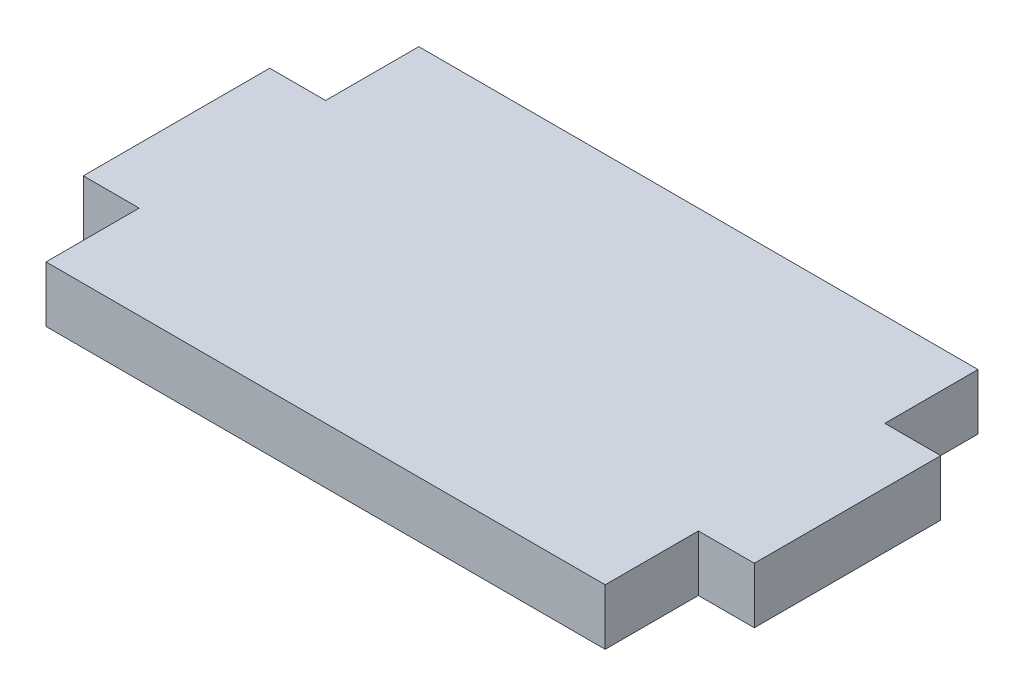
ISO-10303-21;
HEADER;
FILE_DESCRIPTION(('STEP AP214'),'2;1');
FILE_NAME('part.step','',(''),(''),'','','');
FILE_SCHEMA(('AUTOMOTIVE_DESIGN { 1 0 10303 214 1 1 1 1 }'));
ENDSEC;
DATA;
#1=APPLICATION_CONTEXT('core data for automotive mechanical design processes');
#2=APPLICATION_PROTOCOL_DEFINITION('international standard','automotive_design',2000,#1);
#3=PRODUCT_CONTEXT('',#1,'mechanical');
#4=PRODUCT('Part','Part','',(#3));
#5=PRODUCT_RELATED_PRODUCT_CATEGORY('part','',(#4));
#6=PRODUCT_DEFINITION_FORMATION('','',#4);
#7=PRODUCT_DEFINITION_CONTEXT('part definition',#1,'design');
#8=PRODUCT_DEFINITION('design','',#6,#7);
#9=PRODUCT_DEFINITION_SHAPE('','',#8);
#10=(LENGTH_UNIT() NAMED_UNIT(*) SI_UNIT(.MILLI.,.METRE.));
#11=(NAMED_UNIT(*) PLANE_ANGLE_UNIT() SI_UNIT($,.RADIAN.));
#12=(NAMED_UNIT(*) SI_UNIT($,.STERADIAN.) SOLID_ANGLE_UNIT());
#13=UNCERTAINTY_MEASURE_WITH_UNIT(LENGTH_MEASURE(1.E-05),#10,'distance_accuracy_value','');
#14=(GEOMETRIC_REPRESENTATION_CONTEXT(3) GLOBAL_UNCERTAINTY_ASSIGNED_CONTEXT((#13)) GLOBAL_UNIT_ASSIGNED_CONTEXT((#10,
#11,#12)) REPRESENTATION_CONTEXT('',''));
#15=CARTESIAN_POINT('',(0.,0.,0.));
#16=DIRECTION('',(0.,0.,1.));
#17=DIRECTION('',(1.,0.,0.));
#18=AXIS2_PLACEMENT_3D('',#15,#16,#17);
#19=CARTESIAN_POINT('',(-15.,3.,5.));
#20=DIRECTION('',(1.,0.,0.));
#21=DIRECTION('',(0.,0.,-1.));
#22=AXIS2_PLACEMENT_3D('',#19,#20,#21);
#23=PLANE('',#22);
#24=DIRECTION('',(0.,0.,1.));
#25=VECTOR('',#24,1.);
#26=CARTESIAN_POINT('',(-15.,0.,5.));
#27=LINE('',#26,#25);
#28=CARTESIAN_POINT('',(-15.,0.,5.));
#29=VERTEX_POINT('',#28);
#30=CARTESIAN_POINT('',(-15.,0.,10.));
#31=VERTEX_POINT('',#30);
#32=EDGE_CURVE('E153',#29,#31,#27,.T.);
#33=ORIENTED_EDGE('',*,*,#32,.T.);
#34=DIRECTION('',(0.,-1.,0.));
#35=VECTOR('',#34,1.);
#36=CARTESIAN_POINT('',(-15.,3.,10.));
#37=LINE('',#36,#35);
#38=CARTESIAN_POINT('',(-15.,3.,10.));
#39=VERTEX_POINT('',#38);
#40=EDGE_CURVE('E11',#39,#31,#37,.T.);
#41=ORIENTED_EDGE('',*,*,#40,.F.);
#42=DIRECTION('',(0.,0.,1.));
#43=VECTOR('',#42,1.);
#44=CARTESIAN_POINT('',(-15.,3.,5.));
#45=LINE('',#44,#43);
#46=CARTESIAN_POINT('',(-15.,3.,5.));
#47=VERTEX_POINT('',#46);
#48=EDGE_CURVE('E175',#47,#39,#45,.T.);
#49=ORIENTED_EDGE('',*,*,#48,.F.);
#50=DIRECTION('',(0.,-1.,0.));
#51=VECTOR('',#50,1.);
#52=CARTESIAN_POINT('',(-15.,3.,5.));
#53=LINE('',#52,#51);
#54=EDGE_CURVE('E149',#47,#29,#53,.T.);
#55=ORIENTED_EDGE('',*,*,#54,.T.);
#56=EDGE_LOOP('',(#33,#41,#49,#55));
#57=FACE_BOUND('',#56,.T.);
#58=ADVANCED_FACE('F33',(#57),#23,.F.);
#59=CARTESIAN_POINT('',(15.,3.,10.));
#60=DIRECTION('',(0.,0.,-1.));
#61=DIRECTION('',(-1.,0.,0.));
#62=AXIS2_PLACEMENT_3D('',#59,#60,#61);
#63=PLANE('',#62);
#64=DIRECTION('',(1.,0.,0.));
#65=VECTOR('',#64,1.);
#66=CARTESIAN_POINT('',(15.,0.,10.));
#67=LINE('',#66,#65);
#68=CARTESIAN_POINT('',(15.,0.,10.));
#69=VERTEX_POINT('',#68);
#70=EDGE_CURVE('E156',#31,#69,#67,.T.);
#71=ORIENTED_EDGE('',*,*,#70,.T.);
#72=DIRECTION('',(0.,-1.,0.));
#73=VECTOR('',#72,1.);
#74=CARTESIAN_POINT('',(15.,3.,10.));
#75=LINE('',#74,#73);
#76=CARTESIAN_POINT('',(15.,3.,10.));
#77=VERTEX_POINT('',#76);
#78=EDGE_CURVE('E41',#77,#69,#75,.T.);
#79=ORIENTED_EDGE('',*,*,#78,.F.);
#80=DIRECTION('',(1.,0.,0.));
#81=VECTOR('',#80,1.);
#82=CARTESIAN_POINT('',(15.,3.,10.));
#83=LINE('',#82,#81);
#84=EDGE_CURVE('E104',#39,#77,#83,.T.);
#85=ORIENTED_EDGE('',*,*,#84,.F.);
#86=ORIENTED_EDGE('',*,*,#40,.T.);
#87=EDGE_LOOP('',(#71,#79,#85,#86));
#88=FACE_BOUND('',#87,.T.);
#89=ADVANCED_FACE('F253',(#88),#63,.F.);
#90=CARTESIAN_POINT('',(15.,3.,10.));
#91=DIRECTION('',(-1.,0.,0.));
#92=DIRECTION('',(0.,0.,1.));
#93=AXIS2_PLACEMENT_3D('',#90,#91,#92);
#94=PLANE('',#93);
#95=DIRECTION('',(0.,0.,-1.));
#96=VECTOR('',#95,1.);
#97=CARTESIAN_POINT('',(15.,0.,10.));
#98=LINE('',#97,#96);
#99=CARTESIAN_POINT('',(15.,0.,5.));
#100=VERTEX_POINT('',#99);
#101=EDGE_CURVE('E158',#69,#100,#98,.T.);
#102=ORIENTED_EDGE('',*,*,#101,.T.);
#103=DIRECTION('',(0.,-1.,0.));
#104=VECTOR('',#103,1.);
#105=CARTESIAN_POINT('',(15.,3.,5.));
#106=LINE('',#105,#104);
#107=CARTESIAN_POINT('',(15.,3.,5.));
#108=VERTEX_POINT('',#107);
#109=EDGE_CURVE('E194',#108,#100,#106,.T.);
#110=ORIENTED_EDGE('',*,*,#109,.F.);
#111=DIRECTION('',(0.,0.,-1.));
#112=VECTOR('',#111,1.);
#113=CARTESIAN_POINT('',(15.,3.,10.));
#114=LINE('',#113,#112);
#115=EDGE_CURVE('E202',#77,#108,#114,.T.);
#116=ORIENTED_EDGE('',*,*,#115,.F.);
#117=ORIENTED_EDGE('',*,*,#78,.T.);
#118=EDGE_LOOP('',(#102,#110,#116,#117));
#119=FACE_BOUND('',#118,.T.);
#120=ADVANCED_FACE('F200',(#119),#94,.F.);
#121=CARTESIAN_POINT('',(15.,3.,5.));
#122=DIRECTION('',(0.,0.,-1.));
#123=DIRECTION('',(-1.,0.,0.));
#124=AXIS2_PLACEMENT_3D('',#121,#122,#123);
#125=PLANE('',#124);
#126=DIRECTION('',(1.,0.,0.));
#127=VECTOR('',#126,1.);
#128=CARTESIAN_POINT('',(15.,0.,5.));
#129=LINE('',#128,#127);
#130=CARTESIAN_POINT('',(18.,0.,5.));
#131=VERTEX_POINT('',#130);
#132=EDGE_CURVE('E160',#100,#131,#129,.T.);
#133=ORIENTED_EDGE('',*,*,#132,.T.);
#134=DIRECTION('',(0.,-1.,0.));
#135=VECTOR('',#134,1.);
#136=CARTESIAN_POINT('',(18.,3.,5.));
#137=LINE('',#136,#135);
#138=CARTESIAN_POINT('',(18.,3.,5.));
#139=VERTEX_POINT('',#138);
#140=EDGE_CURVE('E191',#139,#131,#137,.T.);
#141=ORIENTED_EDGE('',*,*,#140,.F.);
#142=DIRECTION('',(1.,0.,0.));
#143=VECTOR('',#142,1.);
#144=CARTESIAN_POINT('',(15.,3.,5.));
#145=LINE('',#144,#143);
#146=EDGE_CURVE('E220',#108,#139,#145,.T.);
#147=ORIENTED_EDGE('',*,*,#146,.F.);
#148=ORIENTED_EDGE('',*,*,#109,.T.);
#149=EDGE_LOOP('',(#133,#141,#147,#148));
#150=FACE_BOUND('',#149,.T.);
#151=ADVANCED_FACE('F211',(#150),#125,.F.);
#152=CARTESIAN_POINT('',(18.,3.,5.));
#153=DIRECTION('',(-1.,0.,0.));
#154=DIRECTION('',(0.,0.,1.));
#155=AXIS2_PLACEMENT_3D('',#152,#153,#154);
#156=PLANE('',#155);
#157=DIRECTION('',(0.,0.,-1.));
#158=VECTOR('',#157,1.);
#159=CARTESIAN_POINT('',(18.,0.,5.));
#160=LINE('',#159,#158);
#161=CARTESIAN_POINT('',(18.,0.,-5.));
#162=VERTEX_POINT('',#161);
#163=EDGE_CURVE('E162',#131,#162,#160,.T.);
#164=ORIENTED_EDGE('',*,*,#163,.T.);
#165=DIRECTION('',(0.,-1.,0.));
#166=VECTOR('',#165,1.);
#167=CARTESIAN_POINT('',(18.,3.,-5.));
#168=LINE('',#167,#166);
#169=CARTESIAN_POINT('',(18.,3.,-5.));
#170=VERTEX_POINT('',#169);
#171=EDGE_CURVE('E188',#170,#162,#168,.T.);
#172=ORIENTED_EDGE('',*,*,#171,.F.);
#173=DIRECTION('',(0.,0.,-1.));
#174=VECTOR('',#173,1.);
#175=CARTESIAN_POINT('',(18.,3.,5.));
#176=LINE('',#175,#174);
#177=EDGE_CURVE('E217',#139,#170,#176,.T.);
#178=ORIENTED_EDGE('',*,*,#177,.F.);
#179=ORIENTED_EDGE('',*,*,#140,.T.);
#180=EDGE_LOOP('',(#164,#172,#178,#179));
#181=FACE_BOUND('',#180,.T.);
#182=ADVANCED_FACE('F215',(#181),#156,.F.);
#183=CARTESIAN_POINT('',(18.,3.,-5.));
#184=DIRECTION('',(0.,0.,1.));
#185=DIRECTION('',(1.,0.,0.));
#186=AXIS2_PLACEMENT_3D('',#183,#184,#185);
#187=PLANE('',#186);
#188=DIRECTION('',(-1.,0.,0.));
#189=VECTOR('',#188,1.);
#190=CARTESIAN_POINT('',(18.,0.,-5.));
#191=LINE('',#190,#189);
#192=CARTESIAN_POINT('',(15.,0.,-5.));
#193=VERTEX_POINT('',#192);
#194=EDGE_CURVE('E164',#162,#193,#191,.T.);
#195=ORIENTED_EDGE('',*,*,#194,.T.);
#196=DIRECTION('',(0.,-1.,0.));
#197=VECTOR('',#196,1.);
#198=CARTESIAN_POINT('',(15.,3.,-5.));
#199=LINE('',#198,#197);
#200=CARTESIAN_POINT('',(15.,3.,-5.));
#201=VERTEX_POINT('',#200);
#202=EDGE_CURVE('E185',#201,#193,#199,.T.);
#203=ORIENTED_EDGE('',*,*,#202,.F.);
#204=DIRECTION('',(-1.,0.,0.));
#205=VECTOR('',#204,1.);
#206=CARTESIAN_POINT('',(18.,3.,-5.));
#207=LINE('',#206,#205);
#208=EDGE_CURVE('E219',#170,#201,#207,.T.);
#209=ORIENTED_EDGE('',*,*,#208,.F.);
#210=ORIENTED_EDGE('',*,*,#171,.T.);
#211=EDGE_LOOP('',(#195,#203,#209,#210));
#212=FACE_BOUND('',#211,.T.);
#213=ADVANCED_FACE('F266',(#212),#187,.F.);
#214=CARTESIAN_POINT('',(15.,3.,-5.));
#215=DIRECTION('',(-1.,0.,0.));
#216=DIRECTION('',(0.,0.,1.));
#217=AXIS2_PLACEMENT_3D('',#214,#215,#216);
#218=PLANE('',#217);
#219=DIRECTION('',(0.,0.,-1.));
#220=VECTOR('',#219,1.);
#221=CARTESIAN_POINT('',(15.,0.,-5.));
#222=LINE('',#221,#220);
#223=CARTESIAN_POINT('',(15.,0.,-10.));
#224=VERTEX_POINT('',#223);
#225=EDGE_CURVE('E166',#193,#224,#222,.T.);
#226=ORIENTED_EDGE('',*,*,#225,.T.);
#227=DIRECTION('',(0.,-1.,0.));
#228=VECTOR('',#227,1.);
#229=CARTESIAN_POINT('',(15.,3.,-10.));
#230=LINE('',#229,#228);
#231=CARTESIAN_POINT('',(15.,3.,-10.));
#232=VERTEX_POINT('',#231);
#233=EDGE_CURVE('E182',#232,#224,#230,.T.);
#234=ORIENTED_EDGE('',*,*,#233,.F.);
#235=DIRECTION('',(0.,0.,-1.));
#236=VECTOR('',#235,1.);
#237=CARTESIAN_POINT('',(15.,3.,-5.));
#238=LINE('',#237,#236);
#239=EDGE_CURVE('E222',#201,#232,#238,.T.);
#240=ORIENTED_EDGE('',*,*,#239,.F.);
#241=ORIENTED_EDGE('',*,*,#202,.T.);
#242=EDGE_LOOP('',(#226,#234,#240,#241));
#243=FACE_BOUND('',#242,.T.);
#244=ADVANCED_FACE('F269',(#243),#218,.F.);
#245=CARTESIAN_POINT('',(15.,3.,-10.));
#246=DIRECTION('',(0.,0.,1.));
#247=DIRECTION('',(1.,0.,0.));
#248=AXIS2_PLACEMENT_3D('',#245,#246,#247);
#249=PLANE('',#248);
#250=DIRECTION('',(-1.,0.,0.));
#251=VECTOR('',#250,1.);
#252=CARTESIAN_POINT('',(15.,0.,-10.));
#253=LINE('',#252,#251);
#254=CARTESIAN_POINT('',(-15.,0.,-10.));
#255=VERTEX_POINT('',#254);
#256=EDGE_CURVE('E168',#224,#255,#253,.T.);
#257=ORIENTED_EDGE('',*,*,#256,.T.);
#258=DIRECTION('',(0.,-1.,0.));
#259=VECTOR('',#258,1.);
#260=CARTESIAN_POINT('',(-15.,3.,-10.));
#261=LINE('',#260,#259);
#262=CARTESIAN_POINT('',(-15.,3.,-10.));
#263=VERTEX_POINT('',#262);
#264=EDGE_CURVE('E179',#263,#255,#261,.T.);
#265=ORIENTED_EDGE('',*,*,#264,.F.);
#266=DIRECTION('',(-1.,0.,0.));
#267=VECTOR('',#266,1.);
#268=CARTESIAN_POINT('',(15.,3.,-10.));
#269=LINE('',#268,#267);
#270=EDGE_CURVE('E228',#232,#263,#269,.T.);
#271=ORIENTED_EDGE('',*,*,#270,.F.);
#272=ORIENTED_EDGE('',*,*,#233,.T.);
#273=EDGE_LOOP('',(#257,#265,#271,#272));
#274=FACE_BOUND('',#273,.T.);
#275=ADVANCED_FACE('F234',(#274),#249,.F.);
#276=CARTESIAN_POINT('',(-15.,3.,-10.));
#277=DIRECTION('',(1.,0.,0.));
#278=DIRECTION('',(0.,0.,-1.));
#279=AXIS2_PLACEMENT_3D('',#276,#277,#278);
#280=PLANE('',#279);
#281=DIRECTION('',(0.,0.,1.));
#282=VECTOR('',#281,1.);
#283=CARTESIAN_POINT('',(-15.,0.,-10.));
#284=LINE('',#283,#282);
#285=CARTESIAN_POINT('',(-15.,0.,-5.));
#286=VERTEX_POINT('',#285);
#287=EDGE_CURVE('E170',#255,#286,#284,.T.);
#288=ORIENTED_EDGE('',*,*,#287,.T.);
#289=DIRECTION('',(0.,-1.,0.));
#290=VECTOR('',#289,1.);
#291=CARTESIAN_POINT('',(-15.,3.,-5.));
#292=LINE('',#291,#290);
#293=CARTESIAN_POINT('',(-15.,3.,-5.));
#294=VERTEX_POINT('',#293);
#295=EDGE_CURVE('E144',#294,#286,#292,.T.);
#296=ORIENTED_EDGE('',*,*,#295,.F.);
#297=DIRECTION('',(0.,0.,1.));
#298=VECTOR('',#297,1.);
#299=CARTESIAN_POINT('',(-15.,3.,-10.));
#300=LINE('',#299,#298);
#301=EDGE_CURVE('E135',#263,#294,#300,.T.);
#302=ORIENTED_EDGE('',*,*,#301,.F.);
#303=ORIENTED_EDGE('',*,*,#264,.T.);
#304=EDGE_LOOP('',(#288,#296,#302,#303));
#305=FACE_BOUND('',#304,.T.);
#306=ADVANCED_FACE('F238',(#305),#280,.F.);
#307=CARTESIAN_POINT('',(-15.,3.,-5.));
#308=DIRECTION('',(0.,0.,1.));
#309=DIRECTION('',(1.,0.,0.));
#310=AXIS2_PLACEMENT_3D('',#307,#308,#309);
#311=PLANE('',#310);
#312=DIRECTION('',(-1.,0.,0.));
#313=VECTOR('',#312,1.);
#314=CARTESIAN_POINT('',(-15.,0.,-5.));
#315=LINE('',#314,#313);
#316=CARTESIAN_POINT('',(-18.,0.,-5.));
#317=VERTEX_POINT('',#316);
#318=EDGE_CURVE('E143',#286,#317,#315,.T.);
#319=ORIENTED_EDGE('',*,*,#318,.T.);
#320=DIRECTION('',(0.,-1.,0.));
#321=VECTOR('',#320,1.);
#322=CARTESIAN_POINT('',(-18.,3.,-5.));
#323=LINE('',#322,#321);
#324=CARTESIAN_POINT('',(-18.,3.,-5.));
#325=VERTEX_POINT('',#324);
#326=EDGE_CURVE('E140',#325,#317,#323,.T.);
#327=ORIENTED_EDGE('',*,*,#326,.F.);
#328=DIRECTION('',(-1.,0.,0.));
#329=VECTOR('',#328,1.);
#330=CARTESIAN_POINT('',(-15.,3.,-5.));
#331=LINE('',#330,#329);
#332=EDGE_CURVE('E129',#294,#325,#331,.T.);
#333=ORIENTED_EDGE('',*,*,#332,.F.);
#334=ORIENTED_EDGE('',*,*,#295,.T.);
#335=EDGE_LOOP('',(#319,#327,#333,#334));
#336=FACE_BOUND('',#335,.T.);
#337=ADVANCED_FACE('F141',(#336),#311,.F.);
#338=CARTESIAN_POINT('',(-18.,3.,-5.));
#339=DIRECTION('',(1.,0.,0.));
#340=DIRECTION('',(0.,0.,-1.));
#341=AXIS2_PLACEMENT_3D('',#338,#339,#340);
#342=PLANE('',#341);
#343=DIRECTION('',(0.,0.,1.));
#344=VECTOR('',#343,1.);
#345=CARTESIAN_POINT('',(-18.,0.,-5.));
#346=LINE('',#345,#344);
#347=CARTESIAN_POINT('',(-18.,0.,5.));
#348=VERTEX_POINT('',#347);
#349=EDGE_CURVE('E90',#317,#348,#346,.T.);
#350=ORIENTED_EDGE('',*,*,#349,.T.);
#351=DIRECTION('',(0.,-1.,0.));
#352=VECTOR('',#351,1.);
#353=CARTESIAN_POINT('',(-18.,3.,5.));
#354=LINE('',#353,#352);
#355=CARTESIAN_POINT('',(-18.,3.,5.));
#356=VERTEX_POINT('',#355);
#357=EDGE_CURVE('E145',#356,#348,#354,.T.);
#358=ORIENTED_EDGE('',*,*,#357,.F.);
#359=DIRECTION('',(0.,0.,1.));
#360=VECTOR('',#359,1.);
#361=CARTESIAN_POINT('',(-18.,3.,-5.));
#362=LINE('',#361,#360);
#363=EDGE_CURVE('E133',#325,#356,#362,.T.);
#364=ORIENTED_EDGE('',*,*,#363,.F.);
#365=ORIENTED_EDGE('',*,*,#326,.T.);
#366=EDGE_LOOP('',(#350,#358,#364,#365));
#367=FACE_BOUND('',#366,.T.);
#368=ADVANCED_FACE('F147',(#367),#342,.F.);
#369=CARTESIAN_POINT('',(-18.,3.,5.));
#370=DIRECTION('',(0.,0.,-1.));
#371=DIRECTION('',(-1.,0.,0.));
#372=AXIS2_PLACEMENT_3D('',#369,#370,#371);
#373=PLANE('',#372);
#374=DIRECTION('',(1.,0.,0.));
#375=VECTOR('',#374,1.);
#376=CARTESIAN_POINT('',(-18.,0.,5.));
#377=LINE('',#376,#375);
#378=EDGE_CURVE('E96',#348,#29,#377,.T.);
#379=ORIENTED_EDGE('',*,*,#378,.T.);
#380=ORIENTED_EDGE('',*,*,#54,.F.);
#381=DIRECTION('',(1.,0.,0.));
#382=VECTOR('',#381,1.);
#383=CARTESIAN_POINT('',(-18.,3.,5.));
#384=LINE('',#383,#382);
#385=EDGE_CURVE('E49',#356,#47,#384,.T.);
#386=ORIENTED_EDGE('',*,*,#385,.F.);
#387=ORIENTED_EDGE('',*,*,#357,.T.);
#388=EDGE_LOOP('',(#379,#380,#386,#387));
#389=FACE_BOUND('',#388,.T.);
#390=ADVANCED_FACE('F242',(#389),#373,.F.);
#391=CARTESIAN_POINT('',(0.,3.,0.));
#392=DIRECTION('',(0.,-1.,0.));
#393=DIRECTION('',(0.,0.,-1.));
#394=AXIS2_PLACEMENT_3D('',#391,#392,#393);
#395=PLANE('',#394);
#396=ORIENTED_EDGE('',*,*,#48,.T.);
#397=ORIENTED_EDGE('',*,*,#84,.T.);
#398=ORIENTED_EDGE('',*,*,#115,.T.);
#399=ORIENTED_EDGE('',*,*,#146,.T.);
#400=ORIENTED_EDGE('',*,*,#177,.T.);
#401=ORIENTED_EDGE('',*,*,#208,.T.);
#402=ORIENTED_EDGE('',*,*,#239,.T.);
#403=ORIENTED_EDGE('',*,*,#270,.T.);
#404=ORIENTED_EDGE('',*,*,#301,.T.);
#405=ORIENTED_EDGE('',*,*,#332,.T.);
#406=ORIENTED_EDGE('',*,*,#363,.T.);
#407=ORIENTED_EDGE('',*,*,#385,.T.);
#408=EDGE_LOOP('',(#396,#397,#398,#399,#400,#401,#402,#403,#404,#405,#406,#407));
#409=FACE_BOUND('',#408,.T.);
#410=ADVANCED_FACE('F131',(#409),#395,.F.);
#411=CARTESIAN_POINT('',(0.,0.,0.));
#412=DIRECTION('',(0.,-1.,0.));
#413=DIRECTION('',(0.,0.,-1.));
#414=AXIS2_PLACEMENT_3D('',#411,#412,#413);
#415=PLANE('',#414);
#416=ORIENTED_EDGE('',*,*,#32,.F.);
#417=ORIENTED_EDGE('',*,*,#378,.F.);
#418=ORIENTED_EDGE('',*,*,#349,.F.);
#419=ORIENTED_EDGE('',*,*,#318,.F.);
#420=ORIENTED_EDGE('',*,*,#287,.F.);
#421=ORIENTED_EDGE('',*,*,#256,.F.);
#422=ORIENTED_EDGE('',*,*,#225,.F.);
#423=ORIENTED_EDGE('',*,*,#194,.F.);
#424=ORIENTED_EDGE('',*,*,#163,.F.);
#425=ORIENTED_EDGE('',*,*,#132,.F.);
#426=ORIENTED_EDGE('',*,*,#101,.F.);
#427=ORIENTED_EDGE('',*,*,#70,.F.);
#428=EDGE_LOOP('',(#416,#417,#418,#419,#420,#421,#422,#423,#424,#425,#426,#427));
#429=FACE_BOUND('',#428,.T.);
#430=ADVANCED_FACE('F206',(#429),#415,.T.);
#431=CLOSED_SHELL('',(#58,#89,#120,#151,#182,#213,#244,#275,#306,#337,#368,#390,#410,#430));
#432=MANIFOLD_SOLID_BREP('B2',#431);
#433=ADVANCED_BREP_SHAPE_REPRESENTATION('',(#18,#432),#14);
#434=SHAPE_DEFINITION_REPRESENTATION(#9,#433);
ENDSEC;
END-ISO-10303-21;
